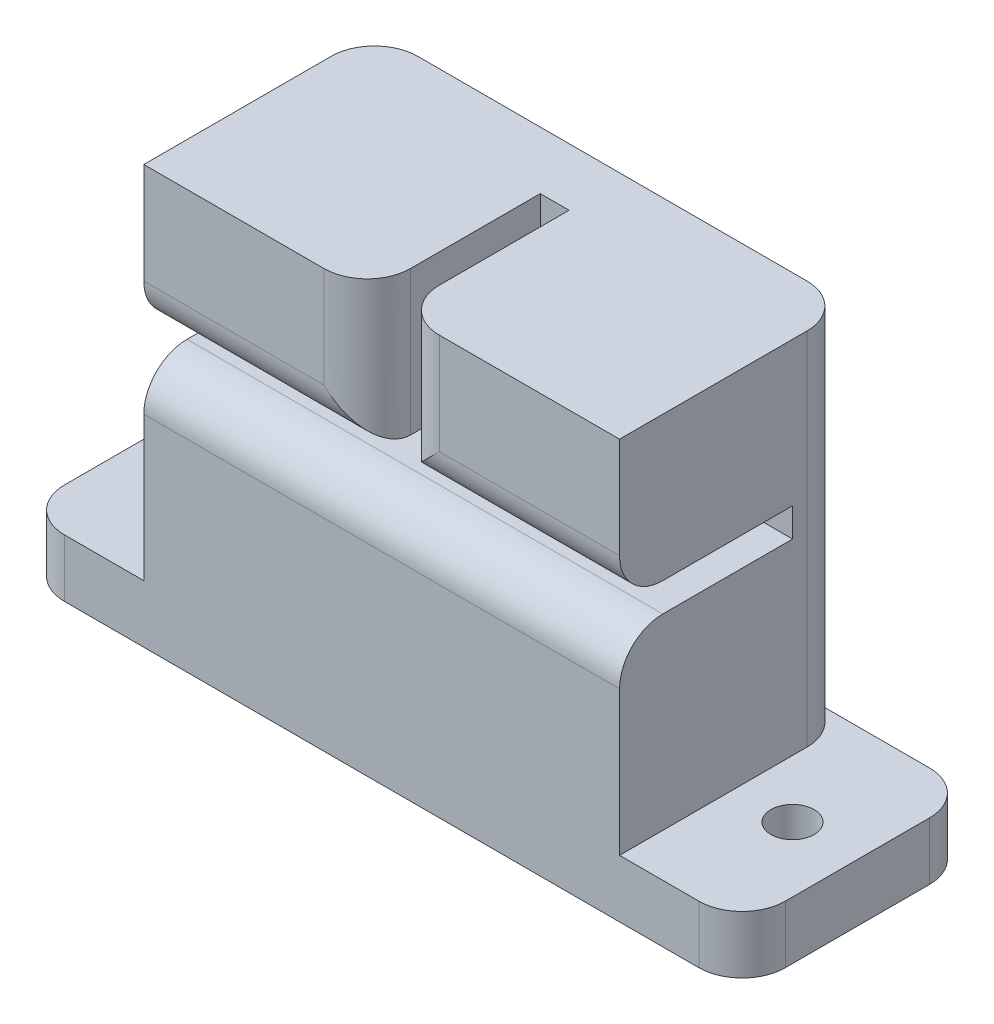
ISO-10303-21;
HEADER;
FILE_DESCRIPTION(('STEP AP214'),'2;1');
FILE_NAME('part.step','',(''),(''),'','','');
FILE_SCHEMA(('AUTOMOTIVE_DESIGN { 1 0 10303 214 1 1 1 1 }'));
ENDSEC;
DATA;
#1=APPLICATION_CONTEXT('core data for automotive mechanical design processes');
#2=APPLICATION_PROTOCOL_DEFINITION('international standard','automotive_design',2000,#1);
#3=PRODUCT_CONTEXT('',#1,'mechanical');
#4=PRODUCT('Part','Part','',(#3));
#5=PRODUCT_RELATED_PRODUCT_CATEGORY('part','',(#4));
#6=PRODUCT_DEFINITION_FORMATION('','',#4);
#7=PRODUCT_DEFINITION_CONTEXT('part definition',#1,'design');
#8=PRODUCT_DEFINITION('design','',#6,#7);
#9=PRODUCT_DEFINITION_SHAPE('','',#8);
#10=(LENGTH_UNIT() NAMED_UNIT(*) SI_UNIT(.MILLI.,.METRE.));
#11=(NAMED_UNIT(*) PLANE_ANGLE_UNIT() SI_UNIT($,.RADIAN.));
#12=(NAMED_UNIT(*) SI_UNIT($,.STERADIAN.) SOLID_ANGLE_UNIT());
#13=UNCERTAINTY_MEASURE_WITH_UNIT(LENGTH_MEASURE(1.E-05),#10,'distance_accuracy_value','');
#14=(GEOMETRIC_REPRESENTATION_CONTEXT(3) GLOBAL_UNCERTAINTY_ASSIGNED_CONTEXT((#13)) GLOBAL_UNIT_ASSIGNED_CONTEXT((#10,
#11,#12)) REPRESENTATION_CONTEXT('',''));
#15=CARTESIAN_POINT('',(0.,0.,0.));
#16=DIRECTION('',(0.,0.,1.));
#17=DIRECTION('',(1.,0.,0.));
#18=AXIS2_PLACEMENT_3D('',#15,#16,#17);
#19=CARTESIAN_POINT('',(0.,14.5,-16.));
#20=DIRECTION('',(0.,-1.,0.));
#21=DIRECTION('',(0.,0.,-1.));
#22=AXIS2_PLACEMENT_3D('',#19,#20,#21);
#23=PLANE('',#22);
#24=DIRECTION('',(0.,0.,1.));
#25=VECTOR('',#24,1.);
#26=CARTESIAN_POINT('',(16.5,14.5,-16.));
#27=LINE('',#26,#25);
#28=CARTESIAN_POINT('',(16.5,14.5,-13.));
#29=VERTEX_POINT('',#28);
#30=CARTESIAN_POINT('',(16.5,14.5,0.));
#31=VERTEX_POINT('',#30);
#32=EDGE_CURVE('E321',#29,#31,#27,.T.);
#33=ORIENTED_EDGE('',*,*,#32,.F.);
#34=CARTESIAN_POINT('',(13.5,14.5,-13.));
#35=DIRECTION('',(0.,-1.,0.));
#36=DIRECTION('',(0.,0.,-1.));
#37=AXIS2_PLACEMENT_3D('',#34,#35,#36);
#38=CIRCLE('',#37,3.);
#39=CARTESIAN_POINT('',(13.5,14.5,-16.));
#40=VERTEX_POINT('',#39);
#41=EDGE_CURVE('E378',#29,#40,#38,.F.);
#42=ORIENTED_EDGE('',*,*,#41,.T.);
#43=DIRECTION('',(1.,0.,0.));
#44=VECTOR('',#43,1.);
#45=CARTESIAN_POINT('',(0.,14.5,-16.));
#46=LINE('',#45,#44);
#47=CARTESIAN_POINT('',(-13.5,14.5,-16.));
#48=VERTEX_POINT('',#47);
#49=EDGE_CURVE('E277',#48,#40,#46,.T.);
#50=ORIENTED_EDGE('',*,*,#49,.F.);
#51=CARTESIAN_POINT('',(-13.5,14.5,-13.));
#52=DIRECTION('',(0.,-1.,0.));
#53=DIRECTION('',(0.,0.,-1.));
#54=AXIS2_PLACEMENT_3D('',#51,#52,#53);
#55=CIRCLE('',#54,3.);
#56=CARTESIAN_POINT('',(-16.5,14.5,-13.));
#57=VERTEX_POINT('',#56);
#58=EDGE_CURVE('E376',#48,#57,#55,.F.);
#59=ORIENTED_EDGE('',*,*,#58,.T.);
#60=DIRECTION('',(0.,0.,1.));
#61=VECTOR('',#60,1.);
#62=CARTESIAN_POINT('',(-16.5,14.5,-16.));
#63=LINE('',#62,#61);
#64=CARTESIAN_POINT('',(-16.5,14.5,0.));
#65=VERTEX_POINT('',#64);
#66=EDGE_CURVE('E319',#57,#65,#63,.T.);
#67=ORIENTED_EDGE('',*,*,#66,.T.);
#68=DIRECTION('',(1.,0.,0.));
#69=VECTOR('',#68,1.);
#70=CARTESIAN_POINT('',(0.,14.5,0.));
#71=LINE('',#70,#69);
#72=CARTESIAN_POINT('',(-4.,14.5,0.));
#73=VERTEX_POINT('',#72);
#74=EDGE_CURVE('E293',#65,#73,#71,.T.);
#75=ORIENTED_EDGE('',*,*,#74,.T.);
#76=CARTESIAN_POINT('',(-4.,14.5,-3.));
#77=DIRECTION('',(0.,-1.,0.));
#78=DIRECTION('',(0.,0.,-1.));
#79=AXIS2_PLACEMENT_3D('',#76,#77,#78);
#80=CIRCLE('',#79,3.);
#81=CARTESIAN_POINT('',(-1.,14.5,-3.));
#82=VERTEX_POINT('',#81);
#83=EDGE_CURVE('E330',#73,#82,#80,.F.);
#84=ORIENTED_EDGE('',*,*,#83,.T.);
#85=DIRECTION('',(0.,0.,1.));
#86=VECTOR('',#85,1.);
#87=CARTESIAN_POINT('',(-1.,14.5,-12.));
#88=LINE('',#87,#86);
#89=CARTESIAN_POINT('',(-1.,14.5,-12.));
#90=VERTEX_POINT('',#89);
#91=EDGE_CURVE('E255',#90,#82,#88,.T.);
#92=ORIENTED_EDGE('',*,*,#91,.F.);
#93=DIRECTION('',(-1.,0.,0.));
#94=VECTOR('',#93,1.);
#95=CARTESIAN_POINT('',(0.,14.5,-12.));
#96=LINE('',#95,#94);
#97=CARTESIAN_POINT('',(1.,14.5,-12.));
#98=VERTEX_POINT('',#97);
#99=EDGE_CURVE('E230',#98,#90,#96,.T.);
#100=ORIENTED_EDGE('',*,*,#99,.F.);
#101=DIRECTION('',(0.,0.,1.));
#102=VECTOR('',#101,1.);
#103=CARTESIAN_POINT('',(1.,14.5,-12.));
#104=LINE('',#103,#102);
#105=CARTESIAN_POINT('',(1.,14.5,-3.));
#106=VERTEX_POINT('',#105);
#107=EDGE_CURVE('E258',#98,#106,#104,.T.);
#108=ORIENTED_EDGE('',*,*,#107,.T.);
#109=CARTESIAN_POINT('',(4.,14.5,-3.));
#110=DIRECTION('',(0.,-1.,0.));
#111=DIRECTION('',(0.,0.,-1.));
#112=AXIS2_PLACEMENT_3D('',#109,#110,#111);
#113=CIRCLE('',#112,3.);
#114=CARTESIAN_POINT('',(4.,14.5,0.));
#115=VERTEX_POINT('',#114);
#116=EDGE_CURVE('E328',#106,#115,#113,.F.);
#117=ORIENTED_EDGE('',*,*,#116,.T.);
#118=EDGE_CURVE('E292',#115,#31,#71,.T.);
#119=ORIENTED_EDGE('',*,*,#118,.T.);
#120=EDGE_LOOP('',(#33,#42,#50,#59,#67,#75,#84,#92,#100,#108,#117,#119));
#121=FACE_BOUND('',#120,.T.);
#122=ADVANCED_FACE('F35',(#121),#23,.F.);
#123=CARTESIAN_POINT('',(16.5,0.,-16.));
#124=DIRECTION('',(-1.,0.,0.));
#125=DIRECTION('',(0.,0.,1.));
#126=AXIS2_PLACEMENT_3D('',#123,#124,#125);
#127=PLANE('',#126);
#128=DIRECTION('',(0.,0.,1.));
#129=VECTOR('',#128,1.);
#130=CARTESIAN_POINT('',(16.5,-10.5,-16.));
#131=LINE('',#130,#129);
#132=CARTESIAN_POINT('',(16.5,-10.5,-13.));
#133=VERTEX_POINT('',#132);
#134=CARTESIAN_POINT('',(16.5,-10.5,0.));
#135=VERTEX_POINT('',#134);
#136=EDGE_CURVE('E286',#133,#135,#131,.T.);
#137=ORIENTED_EDGE('',*,*,#136,.F.);
#138=DIRECTION('',(0.,-1.,0.));
#139=VECTOR('',#138,1.);
#140=CARTESIAN_POINT('',(16.5,0.,-13.));
#141=LINE('',#140,#139);
#142=EDGE_CURVE('E374',#133,#29,#141,.F.);
#143=ORIENTED_EDGE('',*,*,#142,.T.);
#144=ORIENTED_EDGE('',*,*,#32,.T.);
#145=DIRECTION('',(0.,-1.,0.));
#146=VECTOR('',#145,1.);
#147=CARTESIAN_POINT('',(16.5,0.,0.));
#148=LINE('',#147,#146);
#149=CARTESIAN_POINT('',(16.5,7.5,0.));
#150=VERTEX_POINT('',#149);
#151=EDGE_CURVE('E289',#31,#150,#148,.T.);
#152=ORIENTED_EDGE('',*,*,#151,.T.);
#153=CARTESIAN_POINT('',(16.5,7.5,-3.));
#154=DIRECTION('',(-1.,0.,0.));
#155=DIRECTION('',(0.,0.,1.));
#156=AXIS2_PLACEMENT_3D('',#153,#154,#155);
#157=CIRCLE('',#156,3.);
#158=CARTESIAN_POINT('',(16.5,4.5,-3.));
#159=VERTEX_POINT('',#158);
#160=EDGE_CURVE('E342',#150,#159,#157,.F.);
#161=ORIENTED_EDGE('',*,*,#160,.T.);
#162=DIRECTION('',(0.,0.,1.));
#163=VECTOR('',#162,1.);
#164=CARTESIAN_POINT('',(16.5,4.5,-12.));
#165=LINE('',#164,#163);
#166=CARTESIAN_POINT('',(16.5,4.5,-12.));
#167=VERTEX_POINT('',#166);
#168=EDGE_CURVE('E264',#167,#159,#165,.T.);
#169=ORIENTED_EDGE('',*,*,#168,.F.);
#170=DIRECTION('',(0.,1.,0.));
#171=VECTOR('',#170,1.);
#172=CARTESIAN_POINT('',(16.5,0.,-12.));
#173=LINE('',#172,#171);
#174=CARTESIAN_POINT('',(16.5,2.5,-12.));
#175=VERTEX_POINT('',#174);
#176=EDGE_CURVE('E247',#175,#167,#173,.T.);
#177=ORIENTED_EDGE('',*,*,#176,.F.);
#178=DIRECTION('',(0.,0.,1.));
#179=VECTOR('',#178,1.);
#180=CARTESIAN_POINT('',(16.5,2.5,-12.));
#181=LINE('',#180,#179);
#182=CARTESIAN_POINT('',(16.5,2.5,-3.));
#183=VERTEX_POINT('',#182);
#184=EDGE_CURVE('E267',#175,#183,#181,.T.);
#185=ORIENTED_EDGE('',*,*,#184,.T.);
#186=CARTESIAN_POINT('',(16.5,-0.500000000000003,-3.));
#187=DIRECTION('',(-1.,0.,0.));
#188=DIRECTION('',(0.,0.,1.));
#189=AXIS2_PLACEMENT_3D('',#186,#187,#188);
#190=CIRCLE('',#189,3.);
#191=CARTESIAN_POINT('',(16.5,-0.500000000000003,0.));
#192=VERTEX_POINT('',#191);
#193=EDGE_CURVE('E344',#183,#192,#190,.F.);
#194=ORIENTED_EDGE('',*,*,#193,.T.);
#195=EDGE_CURVE('E288',#192,#135,#148,.T.);
#196=ORIENTED_EDGE('',*,*,#195,.T.);
#197=EDGE_LOOP('',(#137,#143,#144,#152,#161,#169,#177,#185,#194,#196));
#198=FACE_BOUND('',#197,.T.);
#199=ADVANCED_FACE('F418',(#198),#127,.F.);
#200=CARTESIAN_POINT('',(0.,0.,0.));
#201=DIRECTION('',(0.,0.,1.));
#202=DIRECTION('',(1.,0.,0.));
#203=AXIS2_PLACEMENT_3D('',#200,#201,#202);
#204=PLANE('',#203);
#205=DIRECTION('',(0.,1.,0.));
#206=VECTOR('',#205,1.);
#207=CARTESIAN_POINT('',(4.,4.5,0.));
#208=LINE('',#207,#206);
#209=CARTESIAN_POINT('',(4.,7.5,0.));
#210=VERTEX_POINT('',#209);
#211=EDGE_CURVE('E348',#115,#210,#208,.F.);
#212=ORIENTED_EDGE('',*,*,#211,.T.);
#213=DIRECTION('',(1.,0.,0.));
#214=VECTOR('',#213,1.);
#215=CARTESIAN_POINT('',(0.,7.5,0.));
#216=LINE('',#215,#214);
#217=EDGE_CURVE('E350',#210,#150,#216,.T.);
#218=ORIENTED_EDGE('',*,*,#217,.T.);
#219=ORIENTED_EDGE('',*,*,#151,.F.);
#220=ORIENTED_EDGE('',*,*,#118,.F.);
#221=EDGE_LOOP('',(#212,#218,#219,#220));
#222=FACE_BOUND('',#221,.T.);
#223=ADVANCED_FACE('F462',(#222),#204,.T.);
#224=DIRECTION('',(1.,0.,0.));
#225=VECTOR('',#224,1.);
#226=CARTESIAN_POINT('',(0.,7.5,0.));
#227=LINE('',#226,#225);
#228=CARTESIAN_POINT('',(-16.5,7.5,0.));
#229=VERTEX_POINT('',#228);
#230=CARTESIAN_POINT('',(-4.,7.5,0.));
#231=VERTEX_POINT('',#230);
#232=EDGE_CURVE('E306',#229,#231,#227,.T.);
#233=ORIENTED_EDGE('',*,*,#232,.T.);
#234=DIRECTION('',(0.,1.,0.));
#235=VECTOR('',#234,1.);
#236=CARTESIAN_POINT('',(-4.,0.,0.));
#237=LINE('',#236,#235);
#238=EDGE_CURVE('E325',#231,#73,#237,.T.);
#239=ORIENTED_EDGE('',*,*,#238,.T.);
#240=ORIENTED_EDGE('',*,*,#74,.F.);
#241=DIRECTION('',(0.,-1.,0.));
#242=VECTOR('',#241,1.);
#243=CARTESIAN_POINT('',(-16.5,0.,0.));
#244=LINE('',#243,#242);
#245=EDGE_CURVE('E297',#65,#229,#244,.T.);
#246=ORIENTED_EDGE('',*,*,#245,.T.);
#247=EDGE_LOOP('',(#233,#239,#240,#246));
#248=FACE_BOUND('',#247,.T.);
#249=ADVANCED_FACE('F444',(#248),#204,.T.);
#250=CARTESIAN_POINT('',(0.,-10.5,-16.));
#251=DIRECTION('',(0.,-1.,0.));
#252=DIRECTION('',(0.,0.,-1.));
#253=AXIS2_PLACEMENT_3D('',#250,#251,#252);
#254=PLANE('',#253);
#255=CARTESIAN_POINT('',(20.5,-10.5,-7.99999999999999));
#256=DIRECTION('',(0.,-1.,0.));
#257=DIRECTION('',(0.,0.,-1.));
#258=AXIS2_PLACEMENT_3D('',#255,#256,#257);
#259=CIRCLE('',#258,1.5);
#260=CARTESIAN_POINT('',(20.5,-10.5,-9.5));
#261=VERTEX_POINT('',#260);
#262=EDGE_CURVE('E774',#261,#261,#259,.F.);
#263=ORIENTED_EDGE('',*,*,#262,.F.);
#264=EDGE_LOOP('',(#263));
#265=FACE_BOUND('',#264,.T.);
#266=DIRECTION('',(0.,0.,1.));
#267=VECTOR('',#266,1.);
#268=CARTESIAN_POINT('',(25.,-10.5,-16.));
#269=LINE('',#268,#267);
#270=CARTESIAN_POINT('',(25.,-10.5,-13.));
#271=VERTEX_POINT('',#270);
#272=CARTESIAN_POINT('',(25.,-10.5,-3.));
#273=VERTEX_POINT('',#272);
#274=EDGE_CURVE('E304',#271,#273,#269,.T.);
#275=ORIENTED_EDGE('',*,*,#274,.F.);
#276=CARTESIAN_POINT('',(22.,-10.5,-13.));
#277=DIRECTION('',(0.,-1.,0.));
#278=DIRECTION('',(0.,0.,-1.));
#279=AXIS2_PLACEMENT_3D('',#276,#277,#278);
#280=CIRCLE('',#279,3.);
#281=CARTESIAN_POINT('',(22.,-10.5,-16.));
#282=VERTEX_POINT('',#281);
#283=EDGE_CURVE('E58',#271,#282,#280,.F.);
#284=ORIENTED_EDGE('',*,*,#283,.T.);
#285=DIRECTION('',(1.,0.,0.));
#286=VECTOR('',#285,1.);
#287=CARTESIAN_POINT('',(0.,-10.5,-16.));
#288=LINE('',#287,#286);
#289=CARTESIAN_POINT('',(13.5,-10.5,-16.));
#290=VERTEX_POINT('',#289);
#291=EDGE_CURVE('E274',#290,#282,#288,.T.);
#292=ORIENTED_EDGE('',*,*,#291,.F.);
#293=CARTESIAN_POINT('',(13.5,-10.5,-13.));
#294=DIRECTION('',(0.,-1.,0.));
#295=DIRECTION('',(0.,0.,-1.));
#296=AXIS2_PLACEMENT_3D('',#293,#294,#295);
#297=CIRCLE('',#296,3.);
#298=EDGE_CURVE('E43',#290,#133,#297,.T.);
#299=ORIENTED_EDGE('',*,*,#298,.T.);
#300=ORIENTED_EDGE('',*,*,#136,.T.);
#301=DIRECTION('',(1.,0.,0.));
#302=VECTOR('',#301,1.);
#303=CARTESIAN_POINT('',(0.,-10.5,0.));
#304=LINE('',#303,#302);
#305=CARTESIAN_POINT('',(22.,-10.5,0.));
#306=VERTEX_POINT('',#305);
#307=EDGE_CURVE('E257',#135,#306,#304,.T.);
#308=ORIENTED_EDGE('',*,*,#307,.T.);
#309=CARTESIAN_POINT('',(22.,-10.5,-3.));
#310=DIRECTION('',(0.,-1.,0.));
#311=DIRECTION('',(0.,0.,-1.));
#312=AXIS2_PLACEMENT_3D('',#309,#310,#311);
#313=CIRCLE('',#312,3.);
#314=EDGE_CURVE('E50',#306,#273,#313,.F.);
#315=ORIENTED_EDGE('',*,*,#314,.T.);
#316=EDGE_LOOP('',(#275,#284,#292,#299,#300,#308,#315));
#317=FACE_BOUND('',#316,.T.);
#318=ADVANCED_FACE('F412',(#265,#317),#254,.F.);
#319=CARTESIAN_POINT('',(25.,0.,-16.));
#320=DIRECTION('',(1.,0.,0.));
#321=DIRECTION('',(0.,0.,-1.));
#322=AXIS2_PLACEMENT_3D('',#319,#320,#321);
#323=PLANE('',#322);
#324=DIRECTION('',(0.,0.,1.));
#325=VECTOR('',#324,1.);
#326=CARTESIAN_POINT('',(25.,-14.5,-16.));
#327=LINE('',#326,#325);
#328=CARTESIAN_POINT('',(25.,-14.5,-13.));
#329=VERTEX_POINT('',#328);
#330=CARTESIAN_POINT('',(25.,-14.5,-3.));
#331=VERTEX_POINT('',#330);
#332=EDGE_CURVE('E307',#329,#331,#327,.T.);
#333=ORIENTED_EDGE('',*,*,#332,.F.);
#334=DIRECTION('',(0.,1.,0.));
#335=VECTOR('',#334,1.);
#336=CARTESIAN_POINT('',(25.,-10.5,-13.));
#337=LINE('',#336,#335);
#338=EDGE_CURVE('E407',#329,#271,#337,.T.);
#339=ORIENTED_EDGE('',*,*,#338,.T.);
#340=ORIENTED_EDGE('',*,*,#274,.T.);
#341=DIRECTION('',(0.,1.,0.));
#342=VECTOR('',#341,1.);
#343=CARTESIAN_POINT('',(25.,0.,-3.));
#344=LINE('',#343,#342);
#345=EDGE_CURVE('E405',#273,#331,#344,.F.);
#346=ORIENTED_EDGE('',*,*,#345,.T.);
#347=EDGE_LOOP('',(#333,#339,#340,#346));
#348=FACE_BOUND('',#347,.T.);
#349=ADVANCED_FACE('F493',(#348),#323,.T.);
#350=CARTESIAN_POINT('',(0.,-14.5,-16.));
#351=DIRECTION('',(0.,-1.,0.));
#352=DIRECTION('',(0.,0.,-1.));
#353=AXIS2_PLACEMENT_3D('',#350,#351,#352);
#354=PLANE('',#353);
#355=CARTESIAN_POINT('',(20.5,-14.5,-7.99999999999999));
#356=DIRECTION('',(0.,-1.,0.));
#357=DIRECTION('',(0.,0.,1.));
#358=AXIS2_PLACEMENT_3D('',#355,#356,#357);
#359=CIRCLE('',#358,1.5);
#360=CARTESIAN_POINT('',(20.5,-14.5,-6.49999999999999));
#361=VERTEX_POINT('',#360);
#362=EDGE_CURVE('E361',#361,#361,#359,.T.);
#363=ORIENTED_EDGE('',*,*,#362,.F.);
#364=EDGE_LOOP('',(#363));
#365=FACE_BOUND('',#364,.T.);
#366=CARTESIAN_POINT('',(-20.5,-14.5,-8.));
#367=DIRECTION('',(0.,-1.,0.));
#368=DIRECTION('',(0.,0.,-1.));
#369=AXIS2_PLACEMENT_3D('',#366,#367,#368);
#370=CIRCLE('',#369,1.5);
#371=CARTESIAN_POINT('',(-20.5,-14.5,-9.5));
#372=VERTEX_POINT('',#371);
#373=EDGE_CURVE('E239',#372,#372,#370,.T.);
#374=ORIENTED_EDGE('',*,*,#373,.F.);
#375=EDGE_LOOP('',(#374));
#376=FACE_BOUND('',#375,.T.);
#377=DIRECTION('',(0.,0.,1.));
#378=VECTOR('',#377,1.);
#379=CARTESIAN_POINT('',(-25.,-14.5,-16.));
#380=LINE('',#379,#378);
#381=CARTESIAN_POINT('',(-25.,-14.5,-13.));
#382=VERTEX_POINT('',#381);
#383=CARTESIAN_POINT('',(-25.,-14.5,-3.));
#384=VERTEX_POINT('',#383);
#385=EDGE_CURVE('E310',#382,#384,#380,.T.);
#386=ORIENTED_EDGE('',*,*,#385,.F.);
#387=CARTESIAN_POINT('',(-22.,-14.5,-13.));
#388=DIRECTION('',(0.,-1.,0.));
#389=DIRECTION('',(0.,0.,-1.));
#390=AXIS2_PLACEMENT_3D('',#387,#388,#389);
#391=CIRCLE('',#390,3.);
#392=CARTESIAN_POINT('',(-22.,-14.5,-16.));
#393=VERTEX_POINT('',#392);
#394=EDGE_CURVE('E398',#382,#393,#391,.T.);
#395=ORIENTED_EDGE('',*,*,#394,.T.);
#396=DIRECTION('',(1.,0.,0.));
#397=VECTOR('',#396,1.);
#398=CARTESIAN_POINT('',(0.,-14.5,-16.));
#399=LINE('',#398,#397);
#400=CARTESIAN_POINT('',(22.,-14.5,-16.));
#401=VERTEX_POINT('',#400);
#402=EDGE_CURVE('E283',#393,#401,#399,.T.);
#403=ORIENTED_EDGE('',*,*,#402,.T.);
#404=CARTESIAN_POINT('',(22.,-14.5,-13.));
#405=DIRECTION('',(0.,-1.,0.));
#406=DIRECTION('',(0.,0.,-1.));
#407=AXIS2_PLACEMENT_3D('',#404,#405,#406);
#408=CIRCLE('',#407,3.);
#409=EDGE_CURVE('E394',#401,#329,#408,.T.);
#410=ORIENTED_EDGE('',*,*,#409,.T.);
#411=ORIENTED_EDGE('',*,*,#332,.T.);
#412=CARTESIAN_POINT('',(22.,-14.5,-3.));
#413=DIRECTION('',(0.,-1.,0.));
#414=DIRECTION('',(0.,0.,-1.));
#415=AXIS2_PLACEMENT_3D('',#412,#413,#414);
#416=CIRCLE('',#415,3.);
#417=CARTESIAN_POINT('',(22.,-14.5,0.));
#418=VERTEX_POINT('',#417);
#419=EDGE_CURVE('E392',#331,#418,#416,.T.);
#420=ORIENTED_EDGE('',*,*,#419,.T.);
#421=DIRECTION('',(1.,0.,0.));
#422=VECTOR('',#421,1.);
#423=CARTESIAN_POINT('',(0.,-14.5,0.));
#424=LINE('',#423,#422);
#425=CARTESIAN_POINT('',(-22.,-14.5,0.));
#426=VERTEX_POINT('',#425);
#427=EDGE_CURVE('E278',#426,#418,#424,.T.);
#428=ORIENTED_EDGE('',*,*,#427,.F.);
#429=CARTESIAN_POINT('',(-22.,-14.5,-3.));
#430=DIRECTION('',(0.,-1.,0.));
#431=DIRECTION('',(0.,0.,-1.));
#432=AXIS2_PLACEMENT_3D('',#429,#430,#431);
#433=CIRCLE('',#432,3.);
#434=EDGE_CURVE('E396',#426,#384,#433,.T.);
#435=ORIENTED_EDGE('',*,*,#434,.T.);
#436=EDGE_LOOP('',(#386,#395,#403,#410,#411,#420,#428,#435));
#437=FACE_BOUND('',#436,.T.);
#438=ADVANCED_FACE('F523',(#365,#376,#437),#354,.T.);
#439=CARTESIAN_POINT('',(-25.,0.,-16.));
#440=DIRECTION('',(1.,0.,0.));
#441=DIRECTION('',(0.,0.,-1.));
#442=AXIS2_PLACEMENT_3D('',#439,#440,#441);
#443=PLANE('',#442);
#444=DIRECTION('',(0.,0.,1.));
#445=VECTOR('',#444,1.);
#446=CARTESIAN_POINT('',(-25.,-10.5,-16.));
#447=LINE('',#446,#445);
#448=CARTESIAN_POINT('',(-25.,-10.5,-13.));
#449=VERTEX_POINT('',#448);
#450=CARTESIAN_POINT('',(-25.,-10.5,-3.));
#451=VERTEX_POINT('',#450);
#452=EDGE_CURVE('E313',#449,#451,#447,.T.);
#453=ORIENTED_EDGE('',*,*,#452,.F.);
#454=DIRECTION('',(0.,1.,0.));
#455=VECTOR('',#454,1.);
#456=CARTESIAN_POINT('',(-25.,0.,-13.));
#457=LINE('',#456,#455);
#458=EDGE_CURVE('E390',#449,#382,#457,.F.);
#459=ORIENTED_EDGE('',*,*,#458,.T.);
#460=ORIENTED_EDGE('',*,*,#385,.T.);
#461=DIRECTION('',(0.,1.,0.));
#462=VECTOR('',#461,1.);
#463=CARTESIAN_POINT('',(-25.,-10.5,-3.));
#464=LINE('',#463,#462);
#465=EDGE_CURVE('E387',#384,#451,#464,.T.);
#466=ORIENTED_EDGE('',*,*,#465,.T.);
#467=EDGE_LOOP('',(#453,#459,#460,#466));
#468=FACE_BOUND('',#467,.T.);
#469=ADVANCED_FACE('F536',(#468),#443,.F.);
#470=CARTESIAN_POINT('',(0.,-10.5,-16.));
#471=DIRECTION('',(0.,-1.,0.));
#472=DIRECTION('',(0.,0.,-1.));
#473=AXIS2_PLACEMENT_3D('',#470,#471,#472);
#474=PLANE('',#473);
#475=CARTESIAN_POINT('',(-20.5,-10.5,-8.));
#476=DIRECTION('',(0.,-1.,0.));
#477=DIRECTION('',(0.,0.,-1.));
#478=AXIS2_PLACEMENT_3D('',#475,#476,#477);
#479=CIRCLE('',#478,1.5);
#480=CARTESIAN_POINT('',(-20.5,-10.5,-9.5));
#481=VERTEX_POINT('',#480);
#482=EDGE_CURVE('E236',#481,#481,#479,.F.);
#483=ORIENTED_EDGE('',*,*,#482,.F.);
#484=EDGE_LOOP('',(#483));
#485=FACE_BOUND('',#484,.T.);
#486=DIRECTION('',(1.,0.,0.));
#487=VECTOR('',#486,1.);
#488=CARTESIAN_POINT('',(0.,-10.5,-16.));
#489=LINE('',#488,#487);
#490=CARTESIAN_POINT('',(-22.,-10.5,-16.));
#491=VERTEX_POINT('',#490);
#492=CARTESIAN_POINT('',(-13.5,-10.5,-16.));
#493=VERTEX_POINT('',#492);
#494=EDGE_CURVE('E281',#491,#493,#489,.T.);
#495=ORIENTED_EDGE('',*,*,#494,.F.);
#496=CARTESIAN_POINT('',(-22.,-10.5,-13.));
#497=DIRECTION('',(0.,-1.,0.));
#498=DIRECTION('',(0.,0.,-1.));
#499=AXIS2_PLACEMENT_3D('',#496,#497,#498);
#500=CIRCLE('',#499,3.);
#501=EDGE_CURVE('E385',#491,#449,#500,.F.);
#502=ORIENTED_EDGE('',*,*,#501,.T.);
#503=ORIENTED_EDGE('',*,*,#452,.T.);
#504=CARTESIAN_POINT('',(-22.,-10.5,-3.));
#505=DIRECTION('',(0.,-1.,0.));
#506=DIRECTION('',(0.,0.,-1.));
#507=AXIS2_PLACEMENT_3D('',#504,#505,#506);
#508=CIRCLE('',#507,3.);
#509=CARTESIAN_POINT('',(-22.,-10.5,0.));
#510=VERTEX_POINT('',#509);
#511=EDGE_CURVE('E383',#451,#510,#508,.F.);
#512=ORIENTED_EDGE('',*,*,#511,.T.);
#513=DIRECTION('',(1.,0.,0.));
#514=VECTOR('',#513,1.);
#515=CARTESIAN_POINT('',(0.,-10.5,0.));
#516=LINE('',#515,#514);
#517=CARTESIAN_POINT('',(-16.5,-10.5,0.));
#518=VERTEX_POINT('',#517);
#519=EDGE_CURVE('E300',#510,#518,#516,.T.);
#520=ORIENTED_EDGE('',*,*,#519,.T.);
#521=DIRECTION('',(0.,0.,1.));
#522=VECTOR('',#521,1.);
#523=CARTESIAN_POINT('',(-16.5,-10.5,-16.));
#524=LINE('',#523,#522);
#525=CARTESIAN_POINT('',(-16.5,-10.5,-13.));
#526=VERTEX_POINT('',#525);
#527=EDGE_CURVE('E316',#526,#518,#524,.T.);
#528=ORIENTED_EDGE('',*,*,#527,.F.);
#529=CARTESIAN_POINT('',(-13.5,-10.5,-13.));
#530=DIRECTION('',(0.,-1.,0.));
#531=DIRECTION('',(0.,0.,-1.));
#532=AXIS2_PLACEMENT_3D('',#529,#530,#531);
#533=CIRCLE('',#532,3.);
#534=EDGE_CURVE('E11',#526,#493,#533,.T.);
#535=ORIENTED_EDGE('',*,*,#534,.T.);
#536=EDGE_LOOP('',(#495,#502,#503,#512,#520,#528,#535));
#537=FACE_BOUND('',#536,.T.);
#538=ADVANCED_FACE('F534',(#485,#537),#474,.F.);
#539=CARTESIAN_POINT('',(-16.5,0.,-16.));
#540=DIRECTION('',(-1.,0.,0.));
#541=DIRECTION('',(0.,0.,1.));
#542=AXIS2_PLACEMENT_3D('',#539,#540,#541);
#543=PLANE('',#542);
#544=ORIENTED_EDGE('',*,*,#66,.F.);
#545=DIRECTION('',(0.,-1.,0.));
#546=VECTOR('',#545,1.);
#547=CARTESIAN_POINT('',(-16.5,-10.5,-13.));
#548=LINE('',#547,#546);
#549=EDGE_CURVE('E380',#57,#526,#548,.T.);
#550=ORIENTED_EDGE('',*,*,#549,.T.);
#551=ORIENTED_EDGE('',*,*,#527,.T.);
#552=CARTESIAN_POINT('',(-16.5,-0.500000000000003,0.));
#553=VERTEX_POINT('',#552);
#554=EDGE_CURVE('E296',#553,#518,#244,.T.);
#555=ORIENTED_EDGE('',*,*,#554,.F.);
#556=CARTESIAN_POINT('',(-16.5,-0.500000000000003,-3.));
#557=DIRECTION('',(-1.,0.,0.));
#558=DIRECTION('',(0.,0.,1.));
#559=AXIS2_PLACEMENT_3D('',#556,#557,#558);
#560=CIRCLE('',#559,3.);
#561=CARTESIAN_POINT('',(-16.5,2.5,-3.));
#562=VERTEX_POINT('',#561);
#563=EDGE_CURVE('E335',#553,#562,#560,.T.);
#564=ORIENTED_EDGE('',*,*,#563,.T.);
#565=DIRECTION('',(0.,0.,1.));
#566=VECTOR('',#565,1.);
#567=CARTESIAN_POINT('',(-16.5,2.5,-12.));
#568=LINE('',#567,#566);
#569=CARTESIAN_POINT('',(-16.5,2.5,-12.));
#570=VERTEX_POINT('',#569);
#571=EDGE_CURVE('E270',#570,#562,#568,.T.);
#572=ORIENTED_EDGE('',*,*,#571,.F.);
#573=DIRECTION('',(0.,-1.,0.));
#574=VECTOR('',#573,1.);
#575=CARTESIAN_POINT('',(-16.5,0.,-12.));
#576=LINE('',#575,#574);
#577=CARTESIAN_POINT('',(-16.5,4.5,-12.));
#578=VERTEX_POINT('',#577);
#579=EDGE_CURVE('E221',#578,#570,#576,.T.);
#580=ORIENTED_EDGE('',*,*,#579,.F.);
#581=DIRECTION('',(0.,0.,1.));
#582=VECTOR('',#581,1.);
#583=CARTESIAN_POINT('',(-16.5,4.5,-12.));
#584=LINE('',#583,#582);
#585=CARTESIAN_POINT('',(-16.5,4.5,-3.));
#586=VERTEX_POINT('',#585);
#587=EDGE_CURVE('E216',#578,#586,#584,.T.);
#588=ORIENTED_EDGE('',*,*,#587,.T.);
#589=CARTESIAN_POINT('',(-16.5,7.5,-3.));
#590=DIRECTION('',(-1.,0.,0.));
#591=DIRECTION('',(0.,0.,1.));
#592=AXIS2_PLACEMENT_3D('',#589,#590,#591);
#593=CIRCLE('',#592,3.);
#594=EDGE_CURVE('E337',#586,#229,#593,.T.);
#595=ORIENTED_EDGE('',*,*,#594,.T.);
#596=ORIENTED_EDGE('',*,*,#245,.F.);
#597=EDGE_LOOP('',(#544,#550,#551,#555,#564,#572,#580,#588,#595,#596));
#598=FACE_BOUND('',#597,.T.);
#599=ADVANCED_FACE('F439',(#598),#543,.T.);
#600=CARTESIAN_POINT('',(0.,0.,-16.));
#601=DIRECTION('',(0.,0.,1.));
#602=DIRECTION('',(1.,0.,0.));
#603=AXIS2_PLACEMENT_3D('',#600,#601,#602);
#604=PLANE('',#603);
#605=ORIENTED_EDGE('',*,*,#49,.T.);
#606=DIRECTION('',(0.,-1.,0.));
#607=VECTOR('',#606,1.);
#608=CARTESIAN_POINT('',(13.5,0.,-16.));
#609=LINE('',#608,#607);
#610=EDGE_CURVE('E371',#40,#290,#609,.T.);
#611=ORIENTED_EDGE('',*,*,#610,.T.);
#612=ORIENTED_EDGE('',*,*,#291,.T.);
#613=DIRECTION('',(0.,1.,0.));
#614=VECTOR('',#613,1.);
#615=CARTESIAN_POINT('',(22.,-14.5,-16.));
#616=LINE('',#615,#614);
#617=EDGE_CURVE('E357',#282,#401,#616,.F.);
#618=ORIENTED_EDGE('',*,*,#617,.T.);
#619=ORIENTED_EDGE('',*,*,#402,.F.);
#620=DIRECTION('',(0.,1.,0.));
#621=VECTOR('',#620,1.);
#622=CARTESIAN_POINT('',(-22.,0.,-16.));
#623=LINE('',#622,#621);
#624=EDGE_CURVE('E366',#393,#491,#623,.T.);
#625=ORIENTED_EDGE('',*,*,#624,.T.);
#626=ORIENTED_EDGE('',*,*,#494,.T.);
#627=DIRECTION('',(0.,-1.,0.));
#628=VECTOR('',#627,1.);
#629=CARTESIAN_POINT('',(-13.5,14.5,-16.));
#630=LINE('',#629,#628);
#631=EDGE_CURVE('E369',#493,#48,#630,.F.);
#632=ORIENTED_EDGE('',*,*,#631,.T.);
#633=EDGE_LOOP('',(#605,#611,#612,#618,#619,#625,#626,#632));
#634=FACE_BOUND('',#633,.T.);
#635=ADVANCED_FACE('F429',(#634),#604,.F.);
#636=ORIENTED_EDGE('',*,*,#519,.F.);
#637=DIRECTION('',(0.,1.,0.));
#638=VECTOR('',#637,1.);
#639=CARTESIAN_POINT('',(-22.,-14.5,0.));
#640=LINE('',#639,#638);
#641=EDGE_CURVE('E403',#510,#426,#640,.F.);
#642=ORIENTED_EDGE('',*,*,#641,.T.);
#643=ORIENTED_EDGE('',*,*,#427,.T.);
#644=DIRECTION('',(0.,1.,0.));
#645=VECTOR('',#644,1.);
#646=CARTESIAN_POINT('',(22.,0.,0.));
#647=LINE('',#646,#645);
#648=EDGE_CURVE('E400',#418,#306,#647,.T.);
#649=ORIENTED_EDGE('',*,*,#648,.T.);
#650=ORIENTED_EDGE('',*,*,#307,.F.);
#651=ORIENTED_EDGE('',*,*,#195,.F.);
#652=DIRECTION('',(1.,0.,0.));
#653=VECTOR('',#652,1.);
#654=CARTESIAN_POINT('',(-16.5,-0.500000000000003,0.));
#655=LINE('',#654,#653);
#656=EDGE_CURVE('E346',#192,#553,#655,.F.);
#657=ORIENTED_EDGE('',*,*,#656,.T.);
#658=ORIENTED_EDGE('',*,*,#554,.T.);
#659=EDGE_LOOP('',(#636,#642,#643,#649,#650,#651,#657,#658));
#660=FACE_BOUND('',#659,.T.);
#661=ADVANCED_FACE('F513',(#660),#204,.T.);
#662=CARTESIAN_POINT('',(-1.,0.,-12.));
#663=DIRECTION('',(1.,0.,0.));
#664=DIRECTION('',(0.,0.,-1.));
#665=AXIS2_PLACEMENT_3D('',#662,#663,#664);
#666=PLANE('',#665);
#667=ORIENTED_EDGE('',*,*,#91,.T.);
#668=DIRECTION('',(0.,1.,0.));
#669=VECTOR('',#668,1.);
#670=CARTESIAN_POINT('',(-1.,0.,-3.));
#671=LINE('',#670,#669);
#672=CARTESIAN_POINT('',(-1.,4.5,-3.));
#673=VERTEX_POINT('',#672);
#674=EDGE_CURVE('E229',#82,#673,#671,.F.);
#675=ORIENTED_EDGE('',*,*,#674,.T.);
#676=DIRECTION('',(0.,0.,1.));
#677=VECTOR('',#676,1.);
#678=CARTESIAN_POINT('',(-1.,4.5,-12.));
#679=LINE('',#678,#677);
#680=CARTESIAN_POINT('',(-1.,4.5,-12.));
#681=VERTEX_POINT('',#680);
#682=EDGE_CURVE('E213',#681,#673,#679,.T.);
#683=ORIENTED_EDGE('',*,*,#682,.F.);
#684=DIRECTION('',(0.,1.,0.));
#685=VECTOR('',#684,1.);
#686=CARTESIAN_POINT('',(-1.,0.,-12.));
#687=LINE('',#686,#685);
#688=EDGE_CURVE('E222',#681,#90,#687,.T.);
#689=ORIENTED_EDGE('',*,*,#688,.T.);
#690=EDGE_LOOP('',(#667,#675,#683,#689));
#691=FACE_BOUND('',#690,.T.);
#692=ADVANCED_FACE('F226',(#691),#666,.T.);
#693=CARTESIAN_POINT('',(1.,0.,-12.));
#694=DIRECTION('',(1.,0.,0.));
#695=DIRECTION('',(0.,1.,0.));
#696=AXIS2_PLACEMENT_3D('',#693,#694,#695);
#697=PLANE('',#696);
#698=DIRECTION('',(0.,0.,1.));
#699=VECTOR('',#698,1.);
#700=CARTESIAN_POINT('',(1.,4.5,-12.));
#701=LINE('',#700,#699);
#702=CARTESIAN_POINT('',(1.,4.5,-12.));
#703=VERTEX_POINT('',#702);
#704=CARTESIAN_POINT('',(1.,4.5,-3.));
#705=VERTEX_POINT('',#704);
#706=EDGE_CURVE('E261',#703,#705,#701,.T.);
#707=ORIENTED_EDGE('',*,*,#706,.T.);
#708=DIRECTION('',(0.,1.,0.));
#709=VECTOR('',#708,1.);
#710=CARTESIAN_POINT('',(1.,14.5,-3.));
#711=LINE('',#710,#709);
#712=EDGE_CURVE('E355',#705,#106,#711,.T.);
#713=ORIENTED_EDGE('',*,*,#712,.T.);
#714=ORIENTED_EDGE('',*,*,#107,.F.);
#715=DIRECTION('',(0.,1.,0.));
#716=VECTOR('',#715,1.);
#717=CARTESIAN_POINT('',(1.,0.,-12.));
#718=LINE('',#717,#716);
#719=EDGE_CURVE('E252',#703,#98,#718,.T.);
#720=ORIENTED_EDGE('',*,*,#719,.F.);
#721=EDGE_LOOP('',(#707,#713,#714,#720));
#722=FACE_BOUND('',#721,.T.);
#723=ADVANCED_FACE('F655',(#722),#697,.F.);
#724=CARTESIAN_POINT('',(0.,4.5,-12.));
#725=DIRECTION('',(0.,-1.,0.));
#726=DIRECTION('',(0.,0.,-1.));
#727=AXIS2_PLACEMENT_3D('',#724,#725,#726);
#728=PLANE('',#727);
#729=ORIENTED_EDGE('',*,*,#168,.T.);
#730=DIRECTION('',(1.,0.,0.));
#731=VECTOR('',#730,1.);
#732=CARTESIAN_POINT('',(0.,4.5,-3.));
#733=LINE('',#732,#731);
#734=EDGE_CURVE('E353',#159,#705,#733,.F.);
#735=ORIENTED_EDGE('',*,*,#734,.T.);
#736=ORIENTED_EDGE('',*,*,#706,.F.);
#737=DIRECTION('',(1.,0.,0.));
#738=VECTOR('',#737,1.);
#739=CARTESIAN_POINT('',(0.,4.5,-12.));
#740=LINE('',#739,#738);
#741=EDGE_CURVE('E250',#703,#167,#740,.T.);
#742=ORIENTED_EDGE('',*,*,#741,.T.);
#743=EDGE_LOOP('',(#729,#735,#736,#742));
#744=FACE_BOUND('',#743,.T.);
#745=ADVANCED_FACE('F469',(#744),#728,.T.);
#746=CARTESIAN_POINT('',(0.,2.5,-12.));
#747=DIRECTION('',(0.,-1.,0.));
#748=DIRECTION('',(0.,0.,-1.));
#749=AXIS2_PLACEMENT_3D('',#746,#747,#748);
#750=PLANE('',#749);
#751=ORIENTED_EDGE('',*,*,#571,.T.);
#752=DIRECTION('',(1.,0.,0.));
#753=VECTOR('',#752,1.);
#754=CARTESIAN_POINT('',(16.5,2.5,-3.));
#755=LINE('',#754,#753);
#756=EDGE_CURVE('E339',#562,#183,#755,.T.);
#757=ORIENTED_EDGE('',*,*,#756,.T.);
#758=ORIENTED_EDGE('',*,*,#184,.F.);
#759=DIRECTION('',(1.,0.,0.));
#760=VECTOR('',#759,1.);
#761=CARTESIAN_POINT('',(0.,2.5,-12.));
#762=LINE('',#761,#760);
#763=EDGE_CURVE('E244',#570,#175,#762,.T.);
#764=ORIENTED_EDGE('',*,*,#763,.F.);
#765=EDGE_LOOP('',(#751,#757,#758,#764));
#766=FACE_BOUND('',#765,.T.);
#767=ADVANCED_FACE('F510',(#766),#750,.F.);
#768=CARTESIAN_POINT('',(0.,4.5,-12.));
#769=DIRECTION('',(0.,-1.,0.));
#770=DIRECTION('',(0.,0.,-1.));
#771=AXIS2_PLACEMENT_3D('',#768,#769,#770);
#772=PLANE('',#771);
#773=ORIENTED_EDGE('',*,*,#682,.T.);
#774=DIRECTION('',(1.,0.,0.));
#775=VECTOR('',#774,1.);
#776=CARTESIAN_POINT('',(0.,4.5,-3.));
#777=LINE('',#776,#775);
#778=EDGE_CURVE('E333',#673,#586,#777,.F.);
#779=ORIENTED_EDGE('',*,*,#778,.T.);
#780=ORIENTED_EDGE('',*,*,#587,.F.);
#781=DIRECTION('',(1.,0.,0.));
#782=VECTOR('',#781,1.);
#783=CARTESIAN_POINT('',(0.,4.5,-12.));
#784=LINE('',#783,#782);
#785=EDGE_CURVE('E210',#578,#681,#784,.T.);
#786=ORIENTED_EDGE('',*,*,#785,.T.);
#787=EDGE_LOOP('',(#773,#779,#780,#786));
#788=FACE_BOUND('',#787,.T.);
#789=ADVANCED_FACE('F212',(#788),#772,.T.);
#790=CARTESIAN_POINT('',(0.,0.,-12.));
#791=DIRECTION('',(0.,0.,1.));
#792=DIRECTION('',(1.,0.,0.));
#793=AXIS2_PLACEMENT_3D('',#790,#791,#792);
#794=PLANE('',#793);
#795=ORIENTED_EDGE('',*,*,#688,.F.);
#796=ORIENTED_EDGE('',*,*,#785,.F.);
#797=ORIENTED_EDGE('',*,*,#579,.T.);
#798=ORIENTED_EDGE('',*,*,#763,.T.);
#799=ORIENTED_EDGE('',*,*,#176,.T.);
#800=ORIENTED_EDGE('',*,*,#741,.F.);
#801=ORIENTED_EDGE('',*,*,#719,.T.);
#802=ORIENTED_EDGE('',*,*,#99,.T.);
#803=EDGE_LOOP('',(#795,#796,#797,#798,#799,#800,#801,#802));
#804=FACE_BOUND('',#803,.T.);
#805=ADVANCED_FACE('F232',(#804),#794,.T.);
#806=CARTESIAN_POINT('',(-20.5,-6.25735931288072,-8.));
#807=DIRECTION('',(0.,-1.,0.));
#808=DIRECTION('',(0.,0.,-1.));
#809=AXIS2_PLACEMENT_3D('',#806,#807,#808);
#810=CYLINDRICAL_SURFACE('',#809,1.5);
#811=ORIENTED_EDGE('',*,*,#482,.T.);
#812=EDGE_LOOP('',(#811));
#813=FACE_BOUND('',#812,.T.);
#814=ORIENTED_EDGE('',*,*,#373,.T.);
#815=EDGE_LOOP('',(#814));
#816=FACE_BOUND('',#815,.T.);
#817=ADVANCED_FACE('F617',(#813,#816),#810,.F.);
#818=CARTESIAN_POINT('',(20.5,-6.25735931288072,-7.99999999999999));
#819=DIRECTION('',(0.,-1.,0.));
#820=DIRECTION('',(0.,0.,-1.));
#821=AXIS2_PLACEMENT_3D('',#818,#819,#820);
#822=CYLINDRICAL_SURFACE('',#821,1.5);
#823=ORIENTED_EDGE('',*,*,#262,.T.);
#824=EDGE_LOOP('',(#823));
#825=FACE_BOUND('',#824,.T.);
#826=ORIENTED_EDGE('',*,*,#362,.T.);
#827=EDGE_LOOP('',(#826));
#828=FACE_BOUND('',#827,.T.);
#829=ADVANCED_FACE('F498',(#825,#828),#822,.F.);
#830=CARTESIAN_POINT('',(0.,7.5,-3.));
#831=DIRECTION('',(1.,0.,0.));
#832=DIRECTION('',(0.,0.,-1.));
#833=AXIS2_PLACEMENT_3D('',#830,#831,#832);
#834=CYLINDRICAL_SURFACE('',#833,3.);
#835=ORIENTED_EDGE('',*,*,#594,.F.);
#836=ORIENTED_EDGE('',*,*,#778,.F.);
#837=CARTESIAN_POINT('',(-4.,7.5,-3.));
#838=DIRECTION('',(0.707106781186547,0.707106781186547,0.));
#839=DIRECTION('',(0.707106781186547,-0.707106781186547,0.));
#840=AXIS2_PLACEMENT_3D('',#837,#838,#839);
#841=ELLIPSE('',#840,4.24264068711928,3.);
#842=EDGE_CURVE('E358',#231,#673,#841,.T.);
#843=ORIENTED_EDGE('',*,*,#842,.F.);
#844=ORIENTED_EDGE('',*,*,#232,.F.);
#845=EDGE_LOOP('',(#835,#836,#843,#844));
#846=FACE_BOUND('',#845,.T.);
#847=ADVANCED_FACE('F447',(#846),#834,.T.);
#848=CARTESIAN_POINT('',(-4.,0.,-3.));
#849=DIRECTION('',(0.,1.,0.));
#850=DIRECTION('',(0.,0.,1.));
#851=AXIS2_PLACEMENT_3D('',#848,#849,#850);
#852=CYLINDRICAL_SURFACE('',#851,3.);
#853=ORIENTED_EDGE('',*,*,#842,.T.);
#854=ORIENTED_EDGE('',*,*,#674,.F.);
#855=ORIENTED_EDGE('',*,*,#83,.F.);
#856=ORIENTED_EDGE('',*,*,#238,.F.);
#857=EDGE_LOOP('',(#853,#854,#855,#856));
#858=FACE_BOUND('',#857,.T.);
#859=ADVANCED_FACE('F450',(#858),#852,.T.);
#860=CARTESIAN_POINT('',(0.,-0.500000000000003,-3.));
#861=DIRECTION('',(-1.,0.,0.));
#862=DIRECTION('',(0.,0.,1.));
#863=AXIS2_PLACEMENT_3D('',#860,#861,#862);
#864=CYLINDRICAL_SURFACE('',#863,3.);
#865=ORIENTED_EDGE('',*,*,#563,.F.);
#866=ORIENTED_EDGE('',*,*,#656,.F.);
#867=ORIENTED_EDGE('',*,*,#193,.F.);
#868=ORIENTED_EDGE('',*,*,#756,.F.);
#869=EDGE_LOOP('',(#865,#866,#867,#868));
#870=FACE_BOUND('',#869,.T.);
#871=ADVANCED_FACE('F479',(#870),#864,.T.);
#872=CARTESIAN_POINT('',(4.,0.,-3.));
#873=DIRECTION('',(0.,-1.,0.));
#874=DIRECTION('',(1.,0.,0.));
#875=AXIS2_PLACEMENT_3D('',#872,#873,#874);
#876=CYLINDRICAL_SURFACE('',#875,3.);
#877=ORIENTED_EDGE('',*,*,#116,.F.);
#878=ORIENTED_EDGE('',*,*,#712,.F.);
#879=CARTESIAN_POINT('',(4.,7.5,-3.));
#880=DIRECTION('',(0.707106781186547,-0.707106781186547,0.));
#881=DIRECTION('',(-0.707106781186547,-0.707106781186548,0.));
#882=AXIS2_PLACEMENT_3D('',#879,#880,#881);
#883=ELLIPSE('',#882,4.24264068711928,3.);
#884=EDGE_CURVE('E362',#210,#705,#883,.T.);
#885=ORIENTED_EDGE('',*,*,#884,.F.);
#886=ORIENTED_EDGE('',*,*,#211,.F.);
#887=EDGE_LOOP('',(#877,#878,#885,#886));
#888=FACE_BOUND('',#887,.T.);
#889=ADVANCED_FACE('F458',(#888),#876,.T.);
#890=CARTESIAN_POINT('',(0.,7.5,-3.));
#891=DIRECTION('',(1.,0.,0.));
#892=DIRECTION('',(0.,0.,-1.));
#893=AXIS2_PLACEMENT_3D('',#890,#891,#892);
#894=CYLINDRICAL_SURFACE('',#893,3.);
#895=ORIENTED_EDGE('',*,*,#884,.T.);
#896=ORIENTED_EDGE('',*,*,#734,.F.);
#897=ORIENTED_EDGE('',*,*,#160,.F.);
#898=ORIENTED_EDGE('',*,*,#217,.F.);
#899=EDGE_LOOP('',(#895,#896,#897,#898));
#900=FACE_BOUND('',#899,.T.);
#901=ADVANCED_FACE('F471',(#900),#894,.T.);
#902=CARTESIAN_POINT('',(13.5,0.,-13.));
#903=DIRECTION('',(0.,-1.,0.));
#904=DIRECTION('',(0.,0.,-1.));
#905=AXIS2_PLACEMENT_3D('',#902,#903,#904);
#906=CYLINDRICAL_SURFACE('',#905,3.);
#907=ORIENTED_EDGE('',*,*,#41,.F.);
#908=ORIENTED_EDGE('',*,*,#142,.F.);
#909=ORIENTED_EDGE('',*,*,#298,.F.);
#910=ORIENTED_EDGE('',*,*,#610,.F.);
#911=EDGE_LOOP('',(#907,#908,#909,#910));
#912=FACE_BOUND('',#911,.T.);
#913=ADVANCED_FACE('F423',(#912),#906,.T.);
#914=CARTESIAN_POINT('',(-13.5,0.,-13.));
#915=DIRECTION('',(0.,1.,0.));
#916=DIRECTION('',(0.,0.,1.));
#917=AXIS2_PLACEMENT_3D('',#914,#915,#916);
#918=CYLINDRICAL_SURFACE('',#917,3.);
#919=ORIENTED_EDGE('',*,*,#58,.F.);
#920=ORIENTED_EDGE('',*,*,#631,.F.);
#921=ORIENTED_EDGE('',*,*,#534,.F.);
#922=ORIENTED_EDGE('',*,*,#549,.F.);
#923=EDGE_LOOP('',(#919,#920,#921,#922));
#924=FACE_BOUND('',#923,.T.);
#925=ADVANCED_FACE('F433',(#924),#918,.T.);
#926=CARTESIAN_POINT('',(-22.,0.,-13.));
#927=DIRECTION('',(0.,1.,0.));
#928=DIRECTION('',(0.,0.,1.));
#929=AXIS2_PLACEMENT_3D('',#926,#927,#928);
#930=CYLINDRICAL_SURFACE('',#929,3.);
#931=ORIENTED_EDGE('',*,*,#394,.F.);
#932=ORIENTED_EDGE('',*,*,#458,.F.);
#933=ORIENTED_EDGE('',*,*,#501,.F.);
#934=ORIENTED_EDGE('',*,*,#624,.F.);
#935=EDGE_LOOP('',(#931,#932,#933,#934));
#936=FACE_BOUND('',#935,.T.);
#937=ADVANCED_FACE('F530',(#936),#930,.T.);
#938=CARTESIAN_POINT('',(-22.,0.,-3.));
#939=DIRECTION('',(0.,-1.,0.));
#940=DIRECTION('',(0.,0.,-1.));
#941=AXIS2_PLACEMENT_3D('',#938,#939,#940);
#942=CYLINDRICAL_SURFACE('',#941,3.);
#943=ORIENTED_EDGE('',*,*,#434,.F.);
#944=ORIENTED_EDGE('',*,*,#641,.F.);
#945=ORIENTED_EDGE('',*,*,#511,.F.);
#946=ORIENTED_EDGE('',*,*,#465,.F.);
#947=EDGE_LOOP('',(#943,#944,#945,#946));
#948=FACE_BOUND('',#947,.T.);
#949=ADVANCED_FACE('F540',(#948),#942,.T.);
#950=CARTESIAN_POINT('',(22.,0.,-13.));
#951=DIRECTION('',(0.,-1.,0.));
#952=DIRECTION('',(0.,0.,-1.));
#953=AXIS2_PLACEMENT_3D('',#950,#951,#952);
#954=CYLINDRICAL_SURFACE('',#953,3.);
#955=ORIENTED_EDGE('',*,*,#409,.F.);
#956=ORIENTED_EDGE('',*,*,#617,.F.);
#957=ORIENTED_EDGE('',*,*,#283,.F.);
#958=ORIENTED_EDGE('',*,*,#338,.F.);
#959=EDGE_LOOP('',(#955,#956,#957,#958));
#960=FACE_BOUND('',#959,.T.);
#961=ADVANCED_FACE('F526',(#960),#954,.T.);
#962=CARTESIAN_POINT('',(22.,0.,-3.));
#963=DIRECTION('',(0.,1.,0.));
#964=DIRECTION('',(0.,0.,1.));
#965=AXIS2_PLACEMENT_3D('',#962,#963,#964);
#966=CYLINDRICAL_SURFACE('',#965,3.);
#967=ORIENTED_EDGE('',*,*,#419,.F.);
#968=ORIENTED_EDGE('',*,*,#345,.F.);
#969=ORIENTED_EDGE('',*,*,#314,.F.);
#970=ORIENTED_EDGE('',*,*,#648,.F.);
#971=EDGE_LOOP('',(#967,#968,#969,#970));
#972=FACE_BOUND('',#971,.T.);
#973=ADVANCED_FACE('F37',(#972),#966,.T.);
#974=CLOSED_SHELL('',(#122,#199,#223,#249,#318,#349,#438,#469,#538,#599,#635,#661,#692,#723,
#745,#767,#789,#805,#817,#829,#847,#859,#871,#889,#901,#913,#925,#937,#949,#961,#973));
#975=MANIFOLD_SOLID_BREP('B2',#974);
#976=ADVANCED_BREP_SHAPE_REPRESENTATION('',(#18,#975),#14);
#977=SHAPE_DEFINITION_REPRESENTATION(#9,#976);
ENDSEC;
END-ISO-10303-21;
